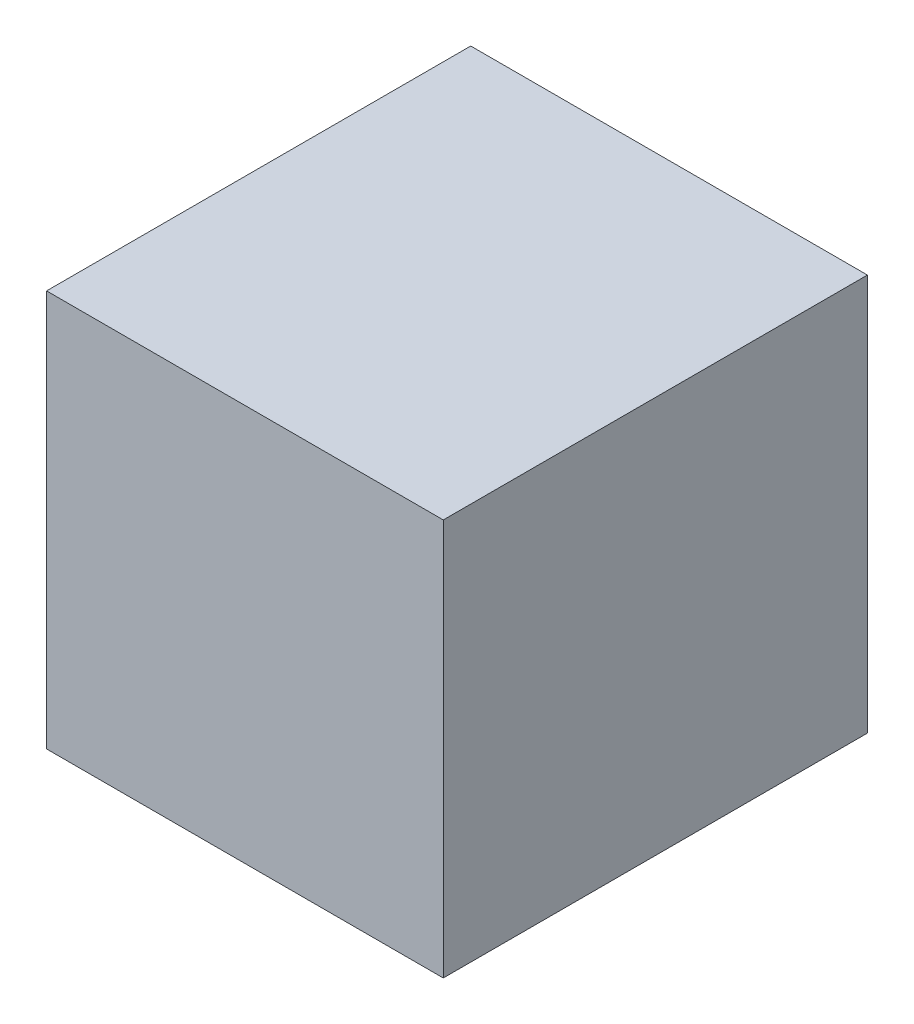
ISO-10303-21;
HEADER;
FILE_DESCRIPTION(('STEP AP214'),'2;1');
FILE_NAME('part.step','',(''),(''),'','','');
FILE_SCHEMA(('AUTOMOTIVE_DESIGN { 1 0 10303 214 1 1 1 1 }'));
ENDSEC;
DATA;
#1=APPLICATION_CONTEXT('core data for automotive mechanical design processes');
#2=APPLICATION_PROTOCOL_DEFINITION('international standard','automotive_design',2000,#1);
#3=PRODUCT_CONTEXT('',#1,'mechanical');
#4=PRODUCT('Part','Part','',(#3));
#5=PRODUCT_RELATED_PRODUCT_CATEGORY('part','',(#4));
#6=PRODUCT_DEFINITION_FORMATION('','',#4);
#7=PRODUCT_DEFINITION_CONTEXT('part definition',#1,'design');
#8=PRODUCT_DEFINITION('design','',#6,#7);
#9=PRODUCT_DEFINITION_SHAPE('','',#8);
#10=(LENGTH_UNIT() NAMED_UNIT(*) SI_UNIT(.MILLI.,.METRE.));
#11=(NAMED_UNIT(*) PLANE_ANGLE_UNIT() SI_UNIT($,.RADIAN.));
#12=(NAMED_UNIT(*) SI_UNIT($,.STERADIAN.) SOLID_ANGLE_UNIT());
#13=UNCERTAINTY_MEASURE_WITH_UNIT(LENGTH_MEASURE(1.E-05),#10,'distance_accuracy_value','');
#14=(GEOMETRIC_REPRESENTATION_CONTEXT(3) GLOBAL_UNCERTAINTY_ASSIGNED_CONTEXT((#13)) GLOBAL_UNIT_ASSIGNED_CONTEXT((#10,
#11,#12)) REPRESENTATION_CONTEXT('',''));
#15=CARTESIAN_POINT('',(0.,0.,0.));
#16=DIRECTION('',(0.,0.,1.));
#17=DIRECTION('',(1.,0.,0.));
#18=AXIS2_PLACEMENT_3D('',#15,#16,#17);
#19=CARTESIAN_POINT('',(0.,0.,-2.));
#20=DIRECTION('',(0.,0.,1.));
#21=DIRECTION('',(1.,0.,0.));
#22=AXIS2_PLACEMENT_3D('',#19,#20,#21);
#23=PLANE('',#22);
#24=DIRECTION('',(0.,-1.,0.));
#25=VECTOR('',#24,1.);
#26=CARTESIAN_POINT('',(15.9,-12.2,-2.));
#27=LINE('',#26,#25);
#28=CARTESIAN_POINT('',(15.9,19.6,-2.));
#29=VERTEX_POINT('',#28);
#30=CARTESIAN_POINT('',(15.9,-12.2,-2.));
#31=VERTEX_POINT('',#30);
#32=EDGE_CURVE('E49',#29,#31,#27,.T.);
#33=ORIENTED_EDGE('',*,*,#32,.F.);
#34=DIRECTION('',(1.,0.,0.));
#35=VECTOR('',#34,1.);
#36=CARTESIAN_POINT('',(-15.9,19.6,-2.));
#37=LINE('',#36,#35);
#38=CARTESIAN_POINT('',(-15.9,19.6,-2.));
#39=VERTEX_POINT('',#38);
#40=EDGE_CURVE('E12',#39,#29,#37,.T.);
#41=ORIENTED_EDGE('',*,*,#40,.F.);
#42=DIRECTION('',(0.,1.,0.));
#43=VECTOR('',#42,1.);
#44=CARTESIAN_POINT('',(-15.9,-12.2,-2.));
#45=LINE('',#44,#43);
#46=CARTESIAN_POINT('',(-15.9,-12.2,-2.));
#47=VERTEX_POINT('',#46);
#48=EDGE_CURVE('E72',#47,#39,#45,.T.);
#49=ORIENTED_EDGE('',*,*,#48,.F.);
#50=DIRECTION('',(-1.,0.,0.));
#51=VECTOR('',#50,1.);
#52=CARTESIAN_POINT('',(-15.9,-12.2,-2.));
#53=LINE('',#52,#51);
#54=EDGE_CURVE('E84',#31,#47,#53,.T.);
#55=ORIENTED_EDGE('',*,*,#54,.F.);
#56=EDGE_LOOP('',(#33,#41,#49,#55));
#57=FACE_BOUND('',#56,.T.);
#58=ADVANCED_FACE('F34',(#57),#23,.T.);
#59=CARTESIAN_POINT('',(15.9,-12.2,-36.));
#60=DIRECTION('',(1.,0.,0.));
#61=DIRECTION('',(0.,1.,0.));
#62=AXIS2_PLACEMENT_3D('',#59,#60,#61);
#63=PLANE('',#62);
#64=DIRECTION('',(0.,0.,1.));
#65=VECTOR('',#64,1.);
#66=CARTESIAN_POINT('',(15.9,19.6,-36.));
#67=LINE('',#66,#65);
#68=CARTESIAN_POINT('',(15.9,19.6,-36.));
#69=VERTEX_POINT('',#68);
#70=EDGE_CURVE('E90',#69,#29,#67,.T.);
#71=ORIENTED_EDGE('',*,*,#70,.T.);
#72=ORIENTED_EDGE('',*,*,#32,.T.);
#73=DIRECTION('',(0.,0.,1.));
#74=VECTOR('',#73,1.);
#75=CARTESIAN_POINT('',(15.9,-12.2,-36.));
#76=LINE('',#75,#74);
#77=CARTESIAN_POINT('',(15.9,-12.2,-36.));
#78=VERTEX_POINT('',#77);
#79=EDGE_CURVE('E42',#78,#31,#76,.T.);
#80=ORIENTED_EDGE('',*,*,#79,.F.);
#81=DIRECTION('',(0.,1.,0.));
#82=VECTOR('',#81,1.);
#83=CARTESIAN_POINT('',(15.9,-12.2,-36.));
#84=LINE('',#83,#82);
#85=EDGE_CURVE('E101',#78,#69,#84,.T.);
#86=ORIENTED_EDGE('',*,*,#85,.T.);
#87=EDGE_LOOP('',(#71,#72,#80,#86));
#88=FACE_BOUND('',#87,.T.);
#89=ADVANCED_FACE('F36',(#88),#63,.T.);
#90=CARTESIAN_POINT('',(-15.9,-12.2,-36.));
#91=DIRECTION('',(0.,-1.,0.));
#92=DIRECTION('',(1.,0.,0.));
#93=AXIS2_PLACEMENT_3D('',#90,#91,#92);
#94=PLANE('',#93);
#95=ORIENTED_EDGE('',*,*,#79,.T.);
#96=ORIENTED_EDGE('',*,*,#54,.T.);
#97=DIRECTION('',(0.,0.,1.));
#98=VECTOR('',#97,1.);
#99=CARTESIAN_POINT('',(-15.9,-12.2,-36.));
#100=LINE('',#99,#98);
#101=CARTESIAN_POINT('',(-15.9,-12.2,-36.));
#102=VERTEX_POINT('',#101);
#103=EDGE_CURVE('E83',#102,#47,#100,.T.);
#104=ORIENTED_EDGE('',*,*,#103,.F.);
#105=DIRECTION('',(1.,0.,0.));
#106=VECTOR('',#105,1.);
#107=CARTESIAN_POINT('',(-15.9,-12.2,-36.));
#108=LINE('',#107,#106);
#109=EDGE_CURVE('E93',#102,#78,#108,.T.);
#110=ORIENTED_EDGE('',*,*,#109,.T.);
#111=EDGE_LOOP('',(#95,#96,#104,#110));
#112=FACE_BOUND('',#111,.T.);
#113=ADVANCED_FACE('F105',(#112),#94,.T.);
#114=CARTESIAN_POINT('',(-15.9,-12.2,-36.));
#115=DIRECTION('',(-1.,0.,0.));
#116=DIRECTION('',(0.,-1.,0.));
#117=AXIS2_PLACEMENT_3D('',#114,#115,#116);
#118=PLANE('',#117);
#119=ORIENTED_EDGE('',*,*,#103,.T.);
#120=ORIENTED_EDGE('',*,*,#48,.T.);
#121=DIRECTION('',(0.,0.,1.));
#122=VECTOR('',#121,1.);
#123=CARTESIAN_POINT('',(-15.9,19.6,-36.));
#124=LINE('',#123,#122);
#125=CARTESIAN_POINT('',(-15.9,19.6,-36.));
#126=VERTEX_POINT('',#125);
#127=EDGE_CURVE('E81',#126,#39,#124,.T.);
#128=ORIENTED_EDGE('',*,*,#127,.F.);
#129=DIRECTION('',(0.,-1.,0.));
#130=VECTOR('',#129,1.);
#131=CARTESIAN_POINT('',(-15.9,-12.2,-36.));
#132=LINE('',#131,#130);
#133=EDGE_CURVE('E98',#126,#102,#132,.T.);
#134=ORIENTED_EDGE('',*,*,#133,.T.);
#135=EDGE_LOOP('',(#119,#120,#128,#134));
#136=FACE_BOUND('',#135,.T.);
#137=ADVANCED_FACE('F79',(#136),#118,.T.);
#138=CARTESIAN_POINT('',(-15.9,19.6,-36.));
#139=DIRECTION('',(0.,1.,0.));
#140=DIRECTION('',(-1.,0.,0.));
#141=AXIS2_PLACEMENT_3D('',#138,#139,#140);
#142=PLANE('',#141);
#143=ORIENTED_EDGE('',*,*,#127,.T.);
#144=ORIENTED_EDGE('',*,*,#40,.T.);
#145=ORIENTED_EDGE('',*,*,#70,.F.);
#146=DIRECTION('',(-1.,0.,0.));
#147=VECTOR('',#146,1.);
#148=CARTESIAN_POINT('',(-15.9,19.6,-36.));
#149=LINE('',#148,#147);
#150=EDGE_CURVE('E89',#69,#126,#149,.T.);
#151=ORIENTED_EDGE('',*,*,#150,.T.);
#152=EDGE_LOOP('',(#143,#144,#145,#151));
#153=FACE_BOUND('',#152,.T.);
#154=ADVANCED_FACE('F87',(#153),#142,.T.);
#155=CARTESIAN_POINT('',(0.,0.,-36.));
#156=DIRECTION('',(0.,0.,-1.));
#157=DIRECTION('',(-1.,0.,0.));
#158=AXIS2_PLACEMENT_3D('',#155,#156,#157);
#159=PLANE('',#158);
#160=ORIENTED_EDGE('',*,*,#85,.F.);
#161=ORIENTED_EDGE('',*,*,#109,.F.);
#162=ORIENTED_EDGE('',*,*,#133,.F.);
#163=ORIENTED_EDGE('',*,*,#150,.F.);
#164=EDGE_LOOP('',(#160,#161,#162,#163));
#165=FACE_BOUND('',#164,.T.);
#166=ADVANCED_FACE('F107',(#165),#159,.T.);
#167=CLOSED_SHELL('',(#58,#89,#113,#137,#154,#166));
#168=MANIFOLD_SOLID_BREP('B2',#167);
#169=ADVANCED_BREP_SHAPE_REPRESENTATION('',(#18,#168),#14);
#170=SHAPE_DEFINITION_REPRESENTATION(#9,#169);
ENDSEC;
END-ISO-10303-21;
